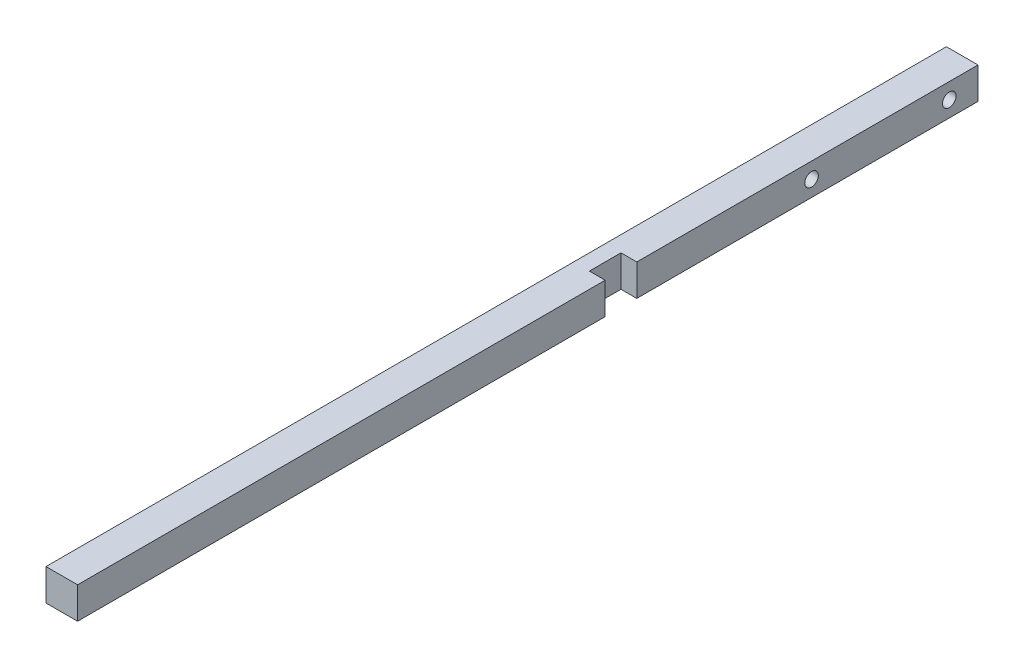
ISO-10303-21;
HEADER;
FILE_DESCRIPTION(('STEP AP214'),'2;1');
FILE_NAME('part.step','',(''),(''),'','','');
FILE_SCHEMA(('AUTOMOTIVE_DESIGN { 1 0 10303 214 1 1 1 1 }'));
ENDSEC;
DATA;
#1=APPLICATION_CONTEXT('core data for automotive mechanical design processes');
#2=APPLICATION_PROTOCOL_DEFINITION('international standard','automotive_design',2000,#1);
#3=PRODUCT_CONTEXT('',#1,'mechanical');
#4=PRODUCT('Part','Part','',(#3));
#5=PRODUCT_RELATED_PRODUCT_CATEGORY('part','',(#4));
#6=PRODUCT_DEFINITION_FORMATION('','',#4);
#7=PRODUCT_DEFINITION_CONTEXT('part definition',#1,'design');
#8=PRODUCT_DEFINITION('design','',#6,#7);
#9=PRODUCT_DEFINITION_SHAPE('','',#8);
#10=(LENGTH_UNIT() NAMED_UNIT(*) SI_UNIT(.MILLI.,.METRE.));
#11=(NAMED_UNIT(*) PLANE_ANGLE_UNIT() SI_UNIT($,.RADIAN.));
#12=(NAMED_UNIT(*) SI_UNIT($,.STERADIAN.) SOLID_ANGLE_UNIT());
#13=UNCERTAINTY_MEASURE_WITH_UNIT(LENGTH_MEASURE(1.E-05),#10,'distance_accuracy_value','');
#14=(GEOMETRIC_REPRESENTATION_CONTEXT(3) GLOBAL_UNCERTAINTY_ASSIGNED_CONTEXT((#13)) GLOBAL_UNIT_ASSIGNED_CONTEXT((#10,
#11,#12)) REPRESENTATION_CONTEXT('',''));
#15=CARTESIAN_POINT('',(0.,0.,0.));
#16=DIRECTION('',(0.,0.,1.));
#17=DIRECTION('',(1.,0.,0.));
#18=AXIS2_PLACEMENT_3D('',#15,#16,#17);
#19=CARTESIAN_POINT('',(5.,5.,323.142135623731));
#20=DIRECTION('',(-1.,0.,0.));
#21=DIRECTION('',(0.,-1.,0.));
#22=AXIS2_PLACEMENT_3D('',#19,#20,#21);
#23=PLANE('',#22);
#24=DIRECTION('',(0.,0.,-1.));
#25=VECTOR('',#24,1.);
#26=CARTESIAN_POINT('',(5.,-5.,323.142135623731));
#27=LINE('',#26,#25);
#28=CARTESIAN_POINT('',(5.,-5.,307.));
#29=VERTEX_POINT('',#28);
#30=CARTESIAN_POINT('',(5.,-5.,140.));
#31=VERTEX_POINT('',#30);
#32=EDGE_CURVE('E163',#29,#31,#27,.T.);
#33=ORIENTED_EDGE('',*,*,#32,.T.);
#34=DIRECTION('',(0.,-1.,0.));
#35=VECTOR('',#34,1.);
#36=CARTESIAN_POINT('',(5.,5.,140.));
#37=LINE('',#36,#35);
#38=CARTESIAN_POINT('',(5.,5.,140.));
#39=VERTEX_POINT('',#38);
#40=EDGE_CURVE('E139',#39,#31,#37,.T.);
#41=ORIENTED_EDGE('',*,*,#40,.F.);
#42=DIRECTION('',(0.,0.,-1.));
#43=VECTOR('',#42,1.);
#44=CARTESIAN_POINT('',(5.,5.,323.142135623731));
#45=LINE('',#44,#43);
#46=CARTESIAN_POINT('',(5.,5.,307.));
#47=VERTEX_POINT('',#46);
#48=EDGE_CURVE('E158',#47,#39,#45,.T.);
#49=ORIENTED_EDGE('',*,*,#48,.F.);
#50=DIRECTION('',(0.,1.,0.));
#51=VECTOR('',#50,1.);
#52=CARTESIAN_POINT('',(5.,5.,307.));
#53=LINE('',#52,#51);
#54=EDGE_CURVE('E12',#29,#47,#53,.T.);
#55=ORIENTED_EDGE('',*,*,#54,.F.);
#56=EDGE_LOOP('',(#33,#41,#49,#55));
#57=FACE_BOUND('',#56,.T.);
#58=ADVANCED_FACE('F38',(#57),#23,.F.);
#59=CARTESIAN_POINT('',(-5.,5.,323.142135623731));
#60=DIRECTION('',(1.,0.,0.));
#61=DIRECTION('',(0.,1.,0.));
#62=AXIS2_PLACEMENT_3D('',#59,#60,#61);
#63=PLANE('',#62);
#64=CARTESIAN_POINT('',(-5.,0.,74.69));
#65=DIRECTION('',(-1.,0.,0.));
#66=DIRECTION('',(0.,0.,1.));
#67=AXIS2_PLACEMENT_3D('',#64,#65,#66);
#68=CIRCLE('',#67,2.14999999999999);
#69=CARTESIAN_POINT('',(-5.,0.,76.84));
#70=VERTEX_POINT('',#69);
#71=EDGE_CURVE('E221',#70,#70,#68,.T.);
#72=ORIENTED_EDGE('',*,*,#71,.F.);
#73=EDGE_LOOP('',(#72));
#74=FACE_BOUND('',#73,.T.);
#75=CARTESIAN_POINT('',(-5.,0.,31.09));
#76=DIRECTION('',(-1.,0.,0.));
#77=DIRECTION('',(0.,0.,1.));
#78=AXIS2_PLACEMENT_3D('',#75,#76,#77);
#79=CIRCLE('',#78,2.14999999999999);
#80=CARTESIAN_POINT('',(-5.,0.,33.24));
#81=VERTEX_POINT('',#80);
#82=EDGE_CURVE('E217',#81,#81,#79,.T.);
#83=ORIENTED_EDGE('',*,*,#82,.F.);
#84=EDGE_LOOP('',(#83));
#85=FACE_BOUND('',#84,.T.);
#86=DIRECTION('',(0.,0.,-1.));
#87=VECTOR('',#86,1.);
#88=CARTESIAN_POINT('',(-5.,5.,323.142135623731));
#89=LINE('',#88,#87);
#90=CARTESIAN_POINT('',(-5.,5.,307.));
#91=VERTEX_POINT('',#90);
#92=CARTESIAN_POINT('',(-5.,5.,22.0000000000001));
#93=VERTEX_POINT('',#92);
#94=EDGE_CURVE('E42',#91,#93,#89,.T.);
#95=ORIENTED_EDGE('',*,*,#94,.T.);
#96=DIRECTION('',(0.,1.,0.));
#97=VECTOR('',#96,1.);
#98=CARTESIAN_POINT('',(-5.,-5.,22.));
#99=LINE('',#98,#97);
#100=CARTESIAN_POINT('',(-5.,-5.,22.));
#101=VERTEX_POINT('',#100);
#102=EDGE_CURVE('E63',#101,#93,#99,.T.);
#103=ORIENTED_EDGE('',*,*,#102,.F.);
#104=DIRECTION('',(0.,0.,-1.));
#105=VECTOR('',#104,1.);
#106=CARTESIAN_POINT('',(-5.,-5.,323.142135623731));
#107=LINE('',#106,#105);
#108=CARTESIAN_POINT('',(-5.,-5.,307.));
#109=VERTEX_POINT('',#108);
#110=EDGE_CURVE('E159',#109,#101,#107,.T.);
#111=ORIENTED_EDGE('',*,*,#110,.F.);
#112=DIRECTION('',(0.,-1.,0.));
#113=VECTOR('',#112,1.);
#114=CARTESIAN_POINT('',(-5.,5.,307.));
#115=LINE('',#114,#113);
#116=EDGE_CURVE('E152',#91,#109,#115,.T.);
#117=ORIENTED_EDGE('',*,*,#116,.F.);
#118=EDGE_LOOP('',(#95,#103,#111,#117));
#119=FACE_BOUND('',#118,.T.);
#120=ADVANCED_FACE('F177',(#74,#85,#119),#63,.F.);
#121=CARTESIAN_POINT('',(-5.,-5.,323.142135623731));
#122=DIRECTION('',(0.,1.,0.));
#123=DIRECTION('',(0.,0.,1.));
#124=AXIS2_PLACEMENT_3D('',#121,#122,#123);
#125=PLANE('',#124);
#126=DIRECTION('',(0.,0.,-1.));
#127=VECTOR('',#126,1.);
#128=CARTESIAN_POINT('',(0.,-5.,130.));
#129=LINE('',#128,#127);
#130=CARTESIAN_POINT('',(0.,-5.,140.));
#131=VERTEX_POINT('',#130);
#132=CARTESIAN_POINT('',(0.,-5.,130.));
#133=VERTEX_POINT('',#132);
#134=EDGE_CURVE('E113',#131,#133,#129,.T.);
#135=ORIENTED_EDGE('',*,*,#134,.F.);
#136=DIRECTION('',(-1.,0.,0.));
#137=VECTOR('',#136,1.);
#138=CARTESIAN_POINT('',(0.,-5.,140.));
#139=LINE('',#138,#137);
#140=EDGE_CURVE('E124',#31,#131,#139,.T.);
#141=ORIENTED_EDGE('',*,*,#140,.F.);
#142=ORIENTED_EDGE('',*,*,#32,.F.);
#143=DIRECTION('',(1.,0.,0.));
#144=VECTOR('',#143,1.);
#145=CARTESIAN_POINT('',(-5.,-5.,307.));
#146=LINE('',#145,#144);
#147=EDGE_CURVE('E47',#109,#29,#146,.T.);
#148=ORIENTED_EDGE('',*,*,#147,.F.);
#149=ORIENTED_EDGE('',*,*,#110,.T.);
#150=DIRECTION('',(1.,0.,0.));
#151=VECTOR('',#150,1.);
#152=CARTESIAN_POINT('',(-5.,-5.,22.));
#153=LINE('',#152,#151);
#154=CARTESIAN_POINT('',(5.,-5.,22.));
#155=VERTEX_POINT('',#154);
#156=EDGE_CURVE('E143',#101,#155,#153,.T.);
#157=ORIENTED_EDGE('',*,*,#156,.T.);
#158=CARTESIAN_POINT('',(5.,-5.,130.));
#159=VERTEX_POINT('',#158);
#160=EDGE_CURVE('E162',#159,#155,#27,.T.);
#161=ORIENTED_EDGE('',*,*,#160,.F.);
#162=DIRECTION('',(1.,0.,0.));
#163=VECTOR('',#162,1.);
#164=CARTESIAN_POINT('',(0.,-5.,130.));
#165=LINE('',#164,#163);
#166=EDGE_CURVE('E127',#133,#159,#165,.T.);
#167=ORIENTED_EDGE('',*,*,#166,.F.);
#168=EDGE_LOOP('',(#135,#141,#142,#148,#149,#157,#161,#167));
#169=FACE_BOUND('',#168,.T.);
#170=ADVANCED_FACE('F174',(#169),#125,.F.);
#171=CARTESIAN_POINT('',(5.,0.,74.69));
#172=DIRECTION('',(-1.,0.,0.));
#173=DIRECTION('',(0.,0.,1.));
#174=AXIS2_PLACEMENT_3D('',#171,#172,#173);
#175=CIRCLE('',#174,2.15);
#176=CARTESIAN_POINT('',(5.,0.,76.84));
#177=VERTEX_POINT('',#176);
#178=EDGE_CURVE('E213',#177,#177,#175,.T.);
#179=ORIENTED_EDGE('',*,*,#178,.T.);
#180=EDGE_LOOP('',(#179));
#181=FACE_BOUND('',#180,.T.);
#182=CARTESIAN_POINT('',(5.,0.,31.09));
#183=DIRECTION('',(-1.,0.,0.));
#184=DIRECTION('',(0.,0.,1.));
#185=AXIS2_PLACEMENT_3D('',#182,#183,#184);
#186=CIRCLE('',#185,2.15);
#187=CARTESIAN_POINT('',(5.,0.,33.24));
#188=VERTEX_POINT('',#187);
#189=EDGE_CURVE('E130',#188,#188,#186,.T.);
#190=ORIENTED_EDGE('',*,*,#189,.T.);
#191=EDGE_LOOP('',(#190));
#192=FACE_BOUND('',#191,.T.);
#193=CARTESIAN_POINT('',(5.,5.,130.));
#194=VERTEX_POINT('',#193);
#195=CARTESIAN_POINT('',(5.,5.,22.));
#196=VERTEX_POINT('',#195);
#197=EDGE_CURVE('E165',#194,#196,#45,.T.);
#198=ORIENTED_EDGE('',*,*,#197,.F.);
#199=DIRECTION('',(0.,-1.,0.));
#200=VECTOR('',#199,1.);
#201=CARTESIAN_POINT('',(5.,5.,130.));
#202=LINE('',#201,#200);
#203=EDGE_CURVE('E55',#194,#159,#202,.T.);
#204=ORIENTED_EDGE('',*,*,#203,.T.);
#205=ORIENTED_EDGE('',*,*,#160,.T.);
#206=DIRECTION('',(0.,1.,0.));
#207=VECTOR('',#206,1.);
#208=CARTESIAN_POINT('',(5.,-5.,22.));
#209=LINE('',#208,#207);
#210=EDGE_CURVE('E146',#155,#196,#209,.T.);
#211=ORIENTED_EDGE('',*,*,#210,.T.);
#212=EDGE_LOOP('',(#198,#204,#205,#211));
#213=FACE_BOUND('',#212,.T.);
#214=ADVANCED_FACE('F171',(#181,#192,#213),#23,.F.);
#215=CARTESIAN_POINT('',(-5.,5.,323.142135623731));
#216=DIRECTION('',(0.,-1.,0.));
#217=DIRECTION('',(0.,0.,-1.));
#218=AXIS2_PLACEMENT_3D('',#215,#216,#217);
#219=PLANE('',#218);
#220=ORIENTED_EDGE('',*,*,#48,.T.);
#221=DIRECTION('',(-1.,0.,0.));
#222=VECTOR('',#221,1.);
#223=CARTESIAN_POINT('',(0.,5.,140.));
#224=LINE('',#223,#222);
#225=CARTESIAN_POINT('',(0.,5.,140.));
#226=VERTEX_POINT('',#225);
#227=EDGE_CURVE('E115',#39,#226,#224,.T.);
#228=ORIENTED_EDGE('',*,*,#227,.T.);
#229=DIRECTION('',(0.,0.,-1.));
#230=VECTOR('',#229,1.);
#231=CARTESIAN_POINT('',(0.,5.,130.));
#232=LINE('',#231,#230);
#233=CARTESIAN_POINT('',(0.,5.,130.));
#234=VERTEX_POINT('',#233);
#235=EDGE_CURVE('E110',#226,#234,#232,.T.);
#236=ORIENTED_EDGE('',*,*,#235,.T.);
#237=DIRECTION('',(1.,0.,0.));
#238=VECTOR('',#237,1.);
#239=CARTESIAN_POINT('',(0.,5.,130.));
#240=LINE('',#239,#238);
#241=EDGE_CURVE('E117',#234,#194,#240,.T.);
#242=ORIENTED_EDGE('',*,*,#241,.T.);
#243=ORIENTED_EDGE('',*,*,#197,.T.);
#244=DIRECTION('',(1.,0.,0.));
#245=VECTOR('',#244,1.);
#246=CARTESIAN_POINT('',(-5.,5.,22.));
#247=LINE('',#246,#245);
#248=EDGE_CURVE('E138',#93,#196,#247,.T.);
#249=ORIENTED_EDGE('',*,*,#248,.F.);
#250=ORIENTED_EDGE('',*,*,#94,.F.);
#251=DIRECTION('',(-1.,0.,0.));
#252=VECTOR('',#251,1.);
#253=CARTESIAN_POINT('',(-5.,5.,307.));
#254=LINE('',#253,#252);
#255=EDGE_CURVE('E155',#47,#91,#254,.T.);
#256=ORIENTED_EDGE('',*,*,#255,.F.);
#257=EDGE_LOOP('',(#220,#228,#236,#242,#243,#249,#250,#256));
#258=FACE_BOUND('',#257,.T.);
#259=ADVANCED_FACE('F123',(#258),#219,.F.);
#260=CARTESIAN_POINT('',(4.99999999999999,194.6,307.));
#261=DIRECTION('',(0.,0.,1.));
#262=DIRECTION('',(0.,1.,0.));
#263=AXIS2_PLACEMENT_3D('',#260,#261,#262);
#264=PLANE('',#263);
#265=ORIENTED_EDGE('',*,*,#255,.T.);
#266=ORIENTED_EDGE('',*,*,#116,.T.);
#267=ORIENTED_EDGE('',*,*,#147,.T.);
#268=ORIENTED_EDGE('',*,*,#54,.T.);
#269=EDGE_LOOP('',(#265,#266,#267,#268));
#270=FACE_BOUND('',#269,.T.);
#271=ADVANCED_FACE('F40',(#270),#264,.T.);
#272=CARTESIAN_POINT('',(-5.,-5.,22.));
#273=DIRECTION('',(0.,0.,1.));
#274=DIRECTION('',(1.,0.,0.));
#275=AXIS2_PLACEMENT_3D('',#272,#273,#274);
#276=PLANE('',#275);
#277=ORIENTED_EDGE('',*,*,#210,.F.);
#278=ORIENTED_EDGE('',*,*,#156,.F.);
#279=ORIENTED_EDGE('',*,*,#102,.T.);
#280=ORIENTED_EDGE('',*,*,#248,.T.);
#281=EDGE_LOOP('',(#277,#278,#279,#280));
#282=FACE_BOUND('',#281,.T.);
#283=ADVANCED_FACE('F170',(#282),#276,.F.);
#284=CARTESIAN_POINT('',(0.,5.,130.));
#285=DIRECTION('',(-1.,0.,0.));
#286=DIRECTION('',(0.,0.,1.));
#287=AXIS2_PLACEMENT_3D('',#284,#285,#286);
#288=PLANE('',#287);
#289=ORIENTED_EDGE('',*,*,#134,.T.);
#290=DIRECTION('',(0.,-1.,0.));
#291=VECTOR('',#290,1.);
#292=CARTESIAN_POINT('',(0.,5.,130.));
#293=LINE('',#292,#291);
#294=EDGE_CURVE('E107',#234,#133,#293,.T.);
#295=ORIENTED_EDGE('',*,*,#294,.F.);
#296=ORIENTED_EDGE('',*,*,#235,.F.);
#297=DIRECTION('',(0.,-1.,0.));
#298=VECTOR('',#297,1.);
#299=CARTESIAN_POINT('',(0.,5.,140.));
#300=LINE('',#299,#298);
#301=EDGE_CURVE('E136',#226,#131,#300,.T.);
#302=ORIENTED_EDGE('',*,*,#301,.T.);
#303=EDGE_LOOP('',(#289,#295,#296,#302));
#304=FACE_BOUND('',#303,.T.);
#305=ADVANCED_FACE('F108',(#304),#288,.F.);
#306=CARTESIAN_POINT('',(0.,5.,140.));
#307=DIRECTION('',(0.,0.,1.));
#308=DIRECTION('',(1.,0.,0.));
#309=AXIS2_PLACEMENT_3D('',#306,#307,#308);
#310=PLANE('',#309);
#311=ORIENTED_EDGE('',*,*,#140,.T.);
#312=ORIENTED_EDGE('',*,*,#301,.F.);
#313=ORIENTED_EDGE('',*,*,#227,.F.);
#314=ORIENTED_EDGE('',*,*,#40,.T.);
#315=EDGE_LOOP('',(#311,#312,#313,#314));
#316=FACE_BOUND('',#315,.T.);
#317=ADVANCED_FACE('F185',(#316),#310,.F.);
#318=CARTESIAN_POINT('',(0.,5.,130.));
#319=DIRECTION('',(0.,0.,-1.));
#320=DIRECTION('',(-1.,0.,0.));
#321=AXIS2_PLACEMENT_3D('',#318,#319,#320);
#322=PLANE('',#321);
#323=ORIENTED_EDGE('',*,*,#166,.T.);
#324=ORIENTED_EDGE('',*,*,#203,.F.);
#325=ORIENTED_EDGE('',*,*,#241,.F.);
#326=ORIENTED_EDGE('',*,*,#294,.T.);
#327=EDGE_LOOP('',(#323,#324,#325,#326));
#328=FACE_BOUND('',#327,.T.);
#329=ADVANCED_FACE('F118',(#328),#322,.F.);
#330=CARTESIAN_POINT('',(-5.,0.,31.09));
#331=DIRECTION('',(-1.,0.,0.));
#332=DIRECTION('',(0.,0.,1.));
#333=AXIS2_PLACEMENT_3D('',#330,#331,#332);
#334=CYLINDRICAL_SURFACE('',#333,2.14999999999999);
#335=ORIENTED_EDGE('',*,*,#189,.F.);
#336=EDGE_LOOP('',(#335));
#337=FACE_BOUND('',#336,.T.);
#338=ORIENTED_EDGE('',*,*,#82,.T.);
#339=EDGE_LOOP('',(#338));
#340=FACE_BOUND('',#339,.T.);
#341=ADVANCED_FACE('F192',(#337,#340),#334,.F.);
#342=CARTESIAN_POINT('',(-5.,0.,74.69));
#343=DIRECTION('',(-1.,0.,0.));
#344=DIRECTION('',(0.,0.,1.));
#345=AXIS2_PLACEMENT_3D('',#342,#343,#344);
#346=CYLINDRICAL_SURFACE('',#345,2.14999999999999);
#347=ORIENTED_EDGE('',*,*,#178,.F.);
#348=EDGE_LOOP('',(#347));
#349=FACE_BOUND('',#348,.T.);
#350=ORIENTED_EDGE('',*,*,#71,.T.);
#351=EDGE_LOOP('',(#350));
#352=FACE_BOUND('',#351,.T.);
#353=ADVANCED_FACE('F227',(#349,#352),#346,.F.);
#354=CLOSED_SHELL('',(#58,#120,#170,#214,#259,#271,#283,#305,#317,#329,#341,#353));
#355=MANIFOLD_SOLID_BREP('B2',#354);
#356=ADVANCED_BREP_SHAPE_REPRESENTATION('',(#18,#355),#14);
#357=SHAPE_DEFINITION_REPRESENTATION(#9,#356);
ENDSEC;
END-ISO-10303-21;
